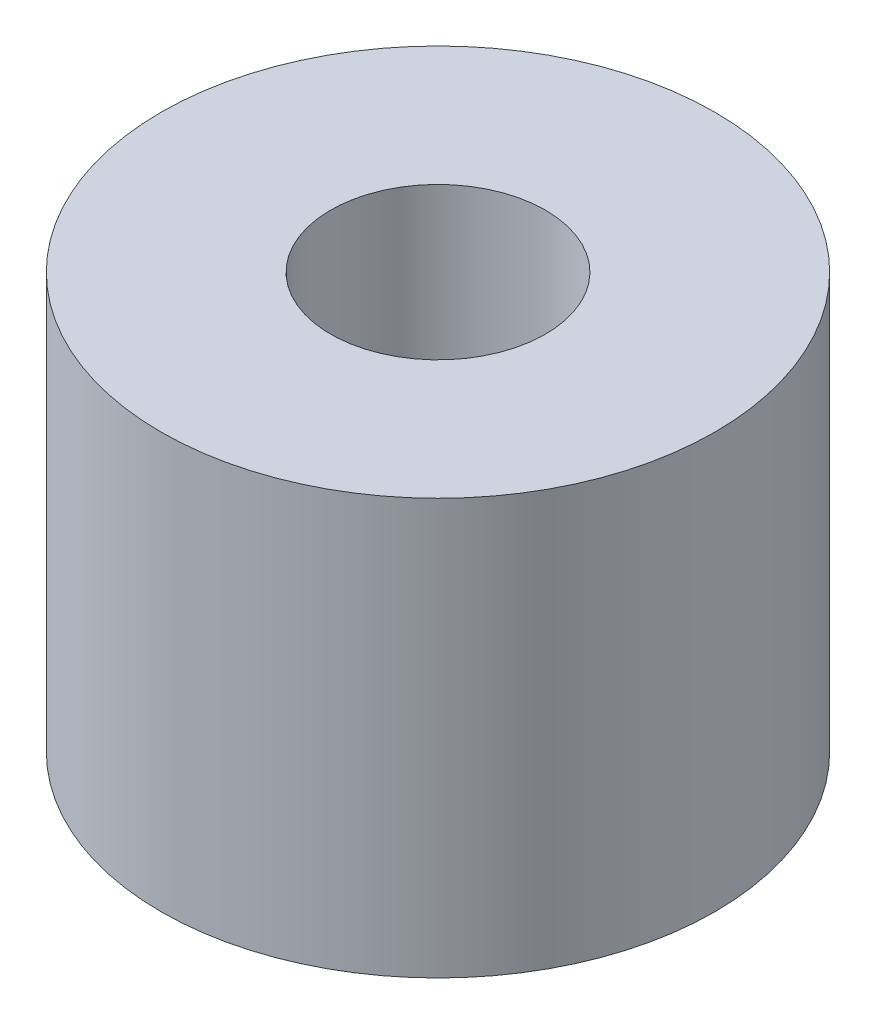
ISO-10303-21;
HEADER;
FILE_DESCRIPTION(('STEP AP214'),'2;1');
FILE_NAME('part.step','',(''),(''),'','','');
FILE_SCHEMA(('AUTOMOTIVE_DESIGN { 1 0 10303 214 1 1 1 1 }'));
ENDSEC;
DATA;
#1=APPLICATION_CONTEXT('core data for automotive mechanical design processes');
#2=APPLICATION_PROTOCOL_DEFINITION('international standard','automotive_design',2000,#1);
#3=PRODUCT_CONTEXT('',#1,'mechanical');
#4=PRODUCT('Part','Part','',(#3));
#5=PRODUCT_RELATED_PRODUCT_CATEGORY('part','',(#4));
#6=PRODUCT_DEFINITION_FORMATION('','',#4);
#7=PRODUCT_DEFINITION_CONTEXT('part definition',#1,'design');
#8=PRODUCT_DEFINITION('design','',#6,#7);
#9=PRODUCT_DEFINITION_SHAPE('','',#8);
#10=(LENGTH_UNIT() NAMED_UNIT(*) SI_UNIT(.MILLI.,.METRE.));
#11=(NAMED_UNIT(*) PLANE_ANGLE_UNIT() SI_UNIT($,.RADIAN.));
#12=(NAMED_UNIT(*) SI_UNIT($,.STERADIAN.) SOLID_ANGLE_UNIT());
#13=UNCERTAINTY_MEASURE_WITH_UNIT(LENGTH_MEASURE(1.E-05),#10,'distance_accuracy_value','');
#14=(GEOMETRIC_REPRESENTATION_CONTEXT(3) GLOBAL_UNCERTAINTY_ASSIGNED_CONTEXT((#13)) GLOBAL_UNIT_ASSIGNED_CONTEXT((#10,
#11,#12)) REPRESENTATION_CONTEXT('',''));
#15=CARTESIAN_POINT('',(0.,0.,0.));
#16=DIRECTION('',(0.,0.,1.));
#17=DIRECTION('',(1.,0.,0.));
#18=AXIS2_PLACEMENT_3D('',#15,#16,#17);
#19=CARTESIAN_POINT('',(0.,4.7625,0.));
#20=DIRECTION('',(0.,-1.,0.));
#21=DIRECTION('',(0.,0.,-1.));
#22=AXIS2_PLACEMENT_3D('',#19,#20,#21);
#23=CYLINDRICAL_SURFACE('',#22,2.4638);
#24=CARTESIAN_POINT('',(0.,-4.7625,0.));
#25=DIRECTION('',(0.,-1.,0.));
#26=DIRECTION('',(0.,0.,-1.));
#27=AXIS2_PLACEMENT_3D('',#24,#25,#26);
#28=CIRCLE('',#27,2.4638);
#29=CARTESIAN_POINT('',(0.,-4.7625,-2.4638));
#30=VERTEX_POINT('',#29);
#31=EDGE_CURVE('E26',#30,#30,#28,.T.);
#32=ORIENTED_EDGE('',*,*,#31,.T.);
#33=EDGE_LOOP('',(#32));
#34=FACE_BOUND('',#33,.T.);
#35=CARTESIAN_POINT('',(0.,4.7625,0.));
#36=DIRECTION('',(0.,-1.,0.));
#37=DIRECTION('',(0.,0.,-1.));
#38=AXIS2_PLACEMENT_3D('',#35,#36,#37);
#39=CIRCLE('',#38,2.4638);
#40=CARTESIAN_POINT('',(0.,4.7625,-2.4638));
#41=VERTEX_POINT('',#40);
#42=EDGE_CURVE('E17',#41,#41,#39,.T.);
#43=ORIENTED_EDGE('',*,*,#42,.F.);
#44=EDGE_LOOP('',(#43));
#45=FACE_BOUND('',#44,.T.);
#46=ADVANCED_FACE('F14',(#34,#45),#23,.F.);
#47=CARTESIAN_POINT('',(0.,4.7625,0.));
#48=DIRECTION('',(0.,1.,0.));
#49=DIRECTION('',(0.,0.,1.));
#50=AXIS2_PLACEMENT_3D('',#47,#48,#49);
#51=PLANE('',#50);
#52=ORIENTED_EDGE('',*,*,#42,.T.);
#53=EDGE_LOOP('',(#52));
#54=FACE_BOUND('',#53,.T.);
#55=CARTESIAN_POINT('',(0.,4.7625,0.));
#56=DIRECTION('',(0.,-1.,0.));
#57=DIRECTION('',(0.,0.,-1.));
#58=AXIS2_PLACEMENT_3D('',#55,#56,#57);
#59=CIRCLE('',#58,6.35);
#60=CARTESIAN_POINT('',(0.,4.7625,-6.35));
#61=VERTEX_POINT('',#60);
#62=EDGE_CURVE('E21',#61,#61,#59,.T.);
#63=ORIENTED_EDGE('',*,*,#62,.F.);
#64=EDGE_LOOP('',(#63));
#65=FACE_BOUND('',#64,.T.);
#66=ADVANCED_FACE('F34',(#54,#65),#51,.T.);
#67=CARTESIAN_POINT('',(0.,-4.7625,0.));
#68=DIRECTION('',(0.,1.,0.));
#69=DIRECTION('',(0.,0.,1.));
#70=AXIS2_PLACEMENT_3D('',#67,#68,#69);
#71=PLANE('',#70);
#72=ORIENTED_EDGE('',*,*,#31,.F.);
#73=EDGE_LOOP('',(#72));
#74=FACE_BOUND('',#73,.T.);
#75=CARTESIAN_POINT('',(0.,-4.7625,0.));
#76=DIRECTION('',(0.,-1.,0.));
#77=DIRECTION('',(0.,0.,-1.));
#78=AXIS2_PLACEMENT_3D('',#75,#76,#77);
#79=CIRCLE('',#78,6.35);
#80=CARTESIAN_POINT('',(0.,-4.7625,-6.35));
#81=VERTEX_POINT('',#80);
#82=EDGE_CURVE('E10',#81,#81,#79,.F.);
#83=ORIENTED_EDGE('',*,*,#82,.F.);
#84=EDGE_LOOP('',(#83));
#85=FACE_BOUND('',#84,.T.);
#86=ADVANCED_FACE('F42',(#74,#85),#71,.F.);
#87=CARTESIAN_POINT('',(0.,4.7625,0.));
#88=DIRECTION('',(0.,-1.,0.));
#89=DIRECTION('',(0.,0.,-1.));
#90=AXIS2_PLACEMENT_3D('',#87,#88,#89);
#91=CYLINDRICAL_SURFACE('',#90,6.35);
#92=ORIENTED_EDGE('',*,*,#82,.T.);
#93=EDGE_LOOP('',(#92));
#94=FACE_BOUND('',#93,.T.);
#95=ORIENTED_EDGE('',*,*,#62,.T.);
#96=EDGE_LOOP('',(#95));
#97=FACE_BOUND('',#96,.T.);
#98=ADVANCED_FACE('F43',(#94,#97),#91,.T.);
#99=CLOSED_SHELL('',(#46,#66,#86,#98));
#100=MANIFOLD_SOLID_BREP('B1',#99);
#101=ADVANCED_BREP_SHAPE_REPRESENTATION('',(#18,#100),#14);
#102=SHAPE_DEFINITION_REPRESENTATION(#9,#101);
ENDSEC;
END-ISO-10303-21;
